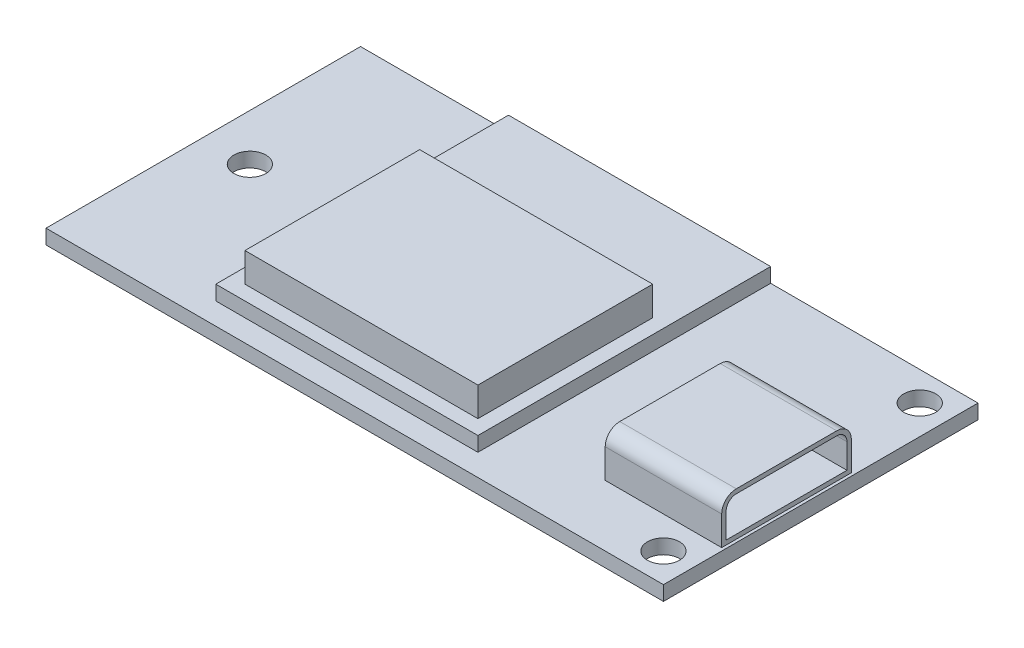
ISO-10303-21;
HEADER;
FILE_DESCRIPTION(('STEP AP214'),'2;1');
FILE_NAME('part.step','',(''),(''),'','','');
FILE_SCHEMA(('AUTOMOTIVE_DESIGN { 1 0 10303 214 1 1 1 1 }'));
ENDSEC;
DATA;
#1=APPLICATION_CONTEXT('core data for automotive mechanical design processes');
#2=APPLICATION_PROTOCOL_DEFINITION('international standard','automotive_design',2000,#1);
#3=PRODUCT_CONTEXT('',#1,'mechanical');
#4=PRODUCT('Part','Part','',(#3));
#5=PRODUCT_RELATED_PRODUCT_CATEGORY('part','',(#4));
#6=PRODUCT_DEFINITION_FORMATION('','',#4);
#7=PRODUCT_DEFINITION_CONTEXT('part definition',#1,'design');
#8=PRODUCT_DEFINITION('design','',#6,#7);
#9=PRODUCT_DEFINITION_SHAPE('','',#8);
#10=(LENGTH_UNIT() NAMED_UNIT(*) SI_UNIT(.MILLI.,.METRE.));
#11=(NAMED_UNIT(*) PLANE_ANGLE_UNIT() SI_UNIT($,.RADIAN.));
#12=(NAMED_UNIT(*) SI_UNIT($,.STERADIAN.) SOLID_ANGLE_UNIT());
#13=UNCERTAINTY_MEASURE_WITH_UNIT(LENGTH_MEASURE(1.E-05),#10,'distance_accuracy_value','');
#14=(GEOMETRIC_REPRESENTATION_CONTEXT(3) GLOBAL_UNCERTAINTY_ASSIGNED_CONTEXT((#13)) GLOBAL_UNIT_ASSIGNED_CONTEXT((#10,
#11,#12)) REPRESENTATION_CONTEXT('',''));
#15=CARTESIAN_POINT('',(0.,0.,0.));
#16=DIRECTION('',(0.,0.,1.));
#17=DIRECTION('',(1.,0.,0.));
#18=AXIS2_PLACEMENT_3D('',#15,#16,#17);
#19=CARTESIAN_POINT('',(6.96,4.,0.));
#20=DIRECTION('',(1.,0.,0.));
#21=DIRECTION('',(0.,0.,-1.));
#22=AXIS2_PLACEMENT_3D('',#19,#20,#21);
#23=PLANE('',#22);
#24=DIRECTION('',(0.,0.,-1.));
#25=VECTOR('',#24,1.);
#26=CARTESIAN_POINT('',(6.96,2.,0.));
#27=LINE('',#26,#25);
#28=CARTESIAN_POINT('',(6.96,2.,9.3));
#29=VERTEX_POINT('',#28);
#30=CARTESIAN_POINT('',(6.96,2.,-10.8));
#31=VERTEX_POINT('',#30);
#32=EDGE_CURVE('E303',#29,#31,#27,.T.);
#33=ORIENTED_EDGE('',*,*,#32,.F.);
#34=DIRECTION('',(0.,-1.,0.));
#35=VECTOR('',#34,1.);
#36=CARTESIAN_POINT('',(6.96,4.,9.3));
#37=LINE('',#36,#35);
#38=CARTESIAN_POINT('',(6.96,1.,9.3));
#39=VERTEX_POINT('',#38);
#40=EDGE_CURVE('E348',#29,#39,#37,.T.);
#41=ORIENTED_EDGE('',*,*,#40,.T.);
#42=DIRECTION('',(0.,0.,1.));
#43=VECTOR('',#42,1.);
#44=CARTESIAN_POINT('',(6.96,1.,0.));
#45=LINE('',#44,#43);
#46=CARTESIAN_POINT('',(6.96,1.,-10.8));
#47=VERTEX_POINT('',#46);
#48=EDGE_CURVE('E339',#47,#39,#45,.T.);
#49=ORIENTED_EDGE('',*,*,#48,.F.);
#50=DIRECTION('',(0.,-1.,0.));
#51=VECTOR('',#50,1.);
#52=CARTESIAN_POINT('',(6.96,2.,-10.8));
#53=LINE('',#52,#51);
#54=EDGE_CURVE('E310',#31,#47,#53,.T.);
#55=ORIENTED_EDGE('',*,*,#54,.F.);
#56=EDGE_LOOP('',(#33,#41,#49,#55));
#57=FACE_BOUND('',#56,.T.);
#58=ADVANCED_FACE('F64',(#57),#23,.T.);
#59=CARTESIAN_POINT('',(-11.04,4.,0.));
#60=DIRECTION('',(1.,0.,0.));
#61=DIRECTION('',(0.,0.,-1.));
#62=AXIS2_PLACEMENT_3D('',#59,#60,#61);
#63=PLANE('',#62);
#64=DIRECTION('',(0.,-1.,0.));
#65=VECTOR('',#64,1.);
#66=CARTESIAN_POINT('',(-11.04,4.,9.3));
#67=LINE('',#66,#65);
#68=CARTESIAN_POINT('',(-11.04,2.,9.3));
#69=VERTEX_POINT('',#68);
#70=CARTESIAN_POINT('',(-11.04,1.,9.3));
#71=VERTEX_POINT('',#70);
#72=EDGE_CURVE('E350',#69,#71,#67,.T.);
#73=ORIENTED_EDGE('',*,*,#72,.F.);
#74=DIRECTION('',(0.,0.,-1.));
#75=VECTOR('',#74,1.);
#76=CARTESIAN_POINT('',(-11.04,2.,0.));
#77=LINE('',#76,#75);
#78=CARTESIAN_POINT('',(-11.04,2.,-10.8));
#79=VERTEX_POINT('',#78);
#80=EDGE_CURVE('E300',#69,#79,#77,.T.);
#81=ORIENTED_EDGE('',*,*,#80,.T.);
#82=DIRECTION('',(0.,-1.,0.));
#83=VECTOR('',#82,1.);
#84=CARTESIAN_POINT('',(-11.04,2.,-10.8));
#85=LINE('',#84,#83);
#86=CARTESIAN_POINT('',(-11.04,1.,-10.8));
#87=VERTEX_POINT('',#86);
#88=EDGE_CURVE('E307',#79,#87,#85,.T.);
#89=ORIENTED_EDGE('',*,*,#88,.T.);
#90=DIRECTION('',(0.,0.,1.));
#91=VECTOR('',#90,1.);
#92=CARTESIAN_POINT('',(-11.04,1.,0.));
#93=LINE('',#92,#91);
#94=EDGE_CURVE('E342',#87,#71,#93,.T.);
#95=ORIENTED_EDGE('',*,*,#94,.T.);
#96=EDGE_LOOP('',(#73,#81,#89,#95));
#97=FACE_BOUND('',#96,.T.);
#98=ADVANCED_FACE('F456',(#97),#63,.F.);
#99=CARTESIAN_POINT('',(0.,4.,9.3));
#100=DIRECTION('',(0.,0.,-1.));
#101=DIRECTION('',(-1.,0.,0.));
#102=AXIS2_PLACEMENT_3D('',#99,#100,#101);
#103=PLANE('',#102);
#104=DIRECTION('',(-1.,0.,0.));
#105=VECTOR('',#104,1.);
#106=CARTESIAN_POINT('',(-11.04,2.,9.3));
#107=LINE('',#106,#105);
#108=EDGE_CURVE('E258',#29,#69,#107,.T.);
#109=ORIENTED_EDGE('',*,*,#108,.T.);
#110=ORIENTED_EDGE('',*,*,#72,.T.);
#111=DIRECTION('',(1.,0.,0.));
#112=VECTOR('',#111,1.);
#113=CARTESIAN_POINT('',(0.,1.,9.3));
#114=LINE('',#113,#112);
#115=EDGE_CURVE('E345',#71,#39,#114,.T.);
#116=ORIENTED_EDGE('',*,*,#115,.T.);
#117=ORIENTED_EDGE('',*,*,#40,.F.);
#118=EDGE_LOOP('',(#109,#110,#116,#117));
#119=FACE_BOUND('',#118,.T.);
#120=ADVANCED_FACE('F462',(#119),#103,.F.);
#121=CARTESIAN_POINT('',(0.,1.,0.));
#122=DIRECTION('',(0.,1.,0.));
#123=DIRECTION('',(0.,0.,1.));
#124=AXIS2_PLACEMENT_3D('',#121,#122,#123);
#125=PLANE('',#124);
#126=ORIENTED_EDGE('',*,*,#94,.F.);
#127=DIRECTION('',(-1.,0.,0.));
#128=VECTOR('',#127,1.);
#129=CARTESIAN_POINT('',(-21.2,1.,-10.8));
#130=LINE('',#129,#128);
#131=CARTESIAN_POINT('',(-21.2,1.,-10.8));
#132=VERTEX_POINT('',#131);
#133=EDGE_CURVE('E374',#87,#132,#130,.T.);
#134=ORIENTED_EDGE('',*,*,#133,.T.);
#135=DIRECTION('',(0.,0.,1.));
#136=VECTOR('',#135,1.);
#137=CARTESIAN_POINT('',(-21.2,1.,-10.8));
#138=LINE('',#137,#136);
#139=CARTESIAN_POINT('',(-21.2,1.,10.8));
#140=VERTEX_POINT('',#139);
#141=EDGE_CURVE('E379',#132,#140,#138,.T.);
#142=ORIENTED_EDGE('',*,*,#141,.T.);
#143=DIRECTION('',(1.,0.,0.));
#144=VECTOR('',#143,1.);
#145=CARTESIAN_POINT('',(-21.2,1.,10.8));
#146=LINE('',#145,#144);
#147=CARTESIAN_POINT('',(21.2,1.,10.8));
#148=VERTEX_POINT('',#147);
#149=EDGE_CURVE('E381',#140,#148,#146,.T.);
#150=ORIENTED_EDGE('',*,*,#149,.T.);
#151=DIRECTION('',(0.,0.,-1.));
#152=VECTOR('',#151,1.);
#153=CARTESIAN_POINT('',(21.2,1.,-10.8));
#154=LINE('',#153,#152);
#155=CARTESIAN_POINT('',(21.2,1.,-10.8));
#156=VERTEX_POINT('',#155);
#157=EDGE_CURVE('E371',#148,#156,#154,.T.);
#158=ORIENTED_EDGE('',*,*,#157,.T.);
#159=EDGE_CURVE('E376',#156,#47,#130,.T.);
#160=ORIENTED_EDGE('',*,*,#159,.T.);
#161=ORIENTED_EDGE('',*,*,#48,.T.);
#162=ORIENTED_EDGE('',*,*,#115,.F.);
#163=EDGE_LOOP('',(#126,#134,#142,#150,#158,#160,#161,#162));
#164=FACE_BOUND('',#163,.T.);
#165=DIRECTION('',(0.,0.,1.));
#166=VECTOR('',#165,1.);
#167=CARTESIAN_POINT('',(21.,1.,0.));
#168=LINE('',#167,#166);
#169=CARTESIAN_POINT('',(21.,1.,-2.3));
#170=VERTEX_POINT('',#169);
#171=CARTESIAN_POINT('',(21.,1.,6.6));
#172=VERTEX_POINT('',#171);
#173=EDGE_CURVE('E313',#170,#172,#168,.T.);
#174=ORIENTED_EDGE('',*,*,#173,.T.);
#175=DIRECTION('',(1.,0.,0.));
#176=VECTOR('',#175,1.);
#177=CARTESIAN_POINT('',(0.,1.,6.6));
#178=LINE('',#177,#176);
#179=CARTESIAN_POINT('',(13.,1.,6.6));
#180=VERTEX_POINT('',#179);
#181=EDGE_CURVE('E318',#180,#172,#178,.T.);
#182=ORIENTED_EDGE('',*,*,#181,.F.);
#183=DIRECTION('',(0.,0.,1.));
#184=VECTOR('',#183,1.);
#185=CARTESIAN_POINT('',(13.,1.,0.));
#186=LINE('',#185,#184);
#187=CARTESIAN_POINT('',(13.,1.,-2.3));
#188=VERTEX_POINT('',#187);
#189=EDGE_CURVE('E327',#188,#180,#186,.T.);
#190=ORIENTED_EDGE('',*,*,#189,.F.);
#191=DIRECTION('',(1.,0.,0.));
#192=VECTOR('',#191,1.);
#193=CARTESIAN_POINT('',(0.,1.,-2.3));
#194=LINE('',#193,#192);
#195=EDGE_CURVE('E324',#188,#170,#194,.T.);
#196=ORIENTED_EDGE('',*,*,#195,.T.);
#197=EDGE_LOOP('',(#174,#182,#190,#196));
#198=FACE_BOUND('',#197,.T.);
#199=CARTESIAN_POINT('',(19.2,1.,-8.8));
#200=DIRECTION('',(0.,1.,0.));
#201=DIRECTION('',(0.,0.,1.));
#202=AXIS2_PLACEMENT_3D('',#199,#200,#201);
#203=CIRCLE('',#202,1.1);
#204=CARTESIAN_POINT('',(19.2,1.,-7.7));
#205=VERTEX_POINT('',#204);
#206=EDGE_CURVE('E359',#205,#205,#203,.T.);
#207=ORIENTED_EDGE('',*,*,#206,.F.);
#208=EDGE_LOOP('',(#207));
#209=FACE_BOUND('',#208,.T.);
#210=CARTESIAN_POINT('',(-18.,1.,0.));
#211=DIRECTION('',(0.,1.,0.));
#212=DIRECTION('',(0.,0.,1.));
#213=AXIS2_PLACEMENT_3D('',#210,#211,#212);
#214=CIRCLE('',#213,1.1);
#215=CARTESIAN_POINT('',(-18.,1.,1.1));
#216=VERTEX_POINT('',#215);
#217=EDGE_CURVE('E365',#216,#216,#214,.T.);
#218=ORIENTED_EDGE('',*,*,#217,.F.);
#219=EDGE_LOOP('',(#218));
#220=FACE_BOUND('',#219,.T.);
#221=CARTESIAN_POINT('',(19.2,1.,8.8));
#222=DIRECTION('',(0.,1.,0.));
#223=DIRECTION('',(0.,0.,1.));
#224=AXIS2_PLACEMENT_3D('',#221,#222,#223);
#225=CIRCLE('',#224,1.1);
#226=CARTESIAN_POINT('',(19.2,1.,9.9));
#227=VERTEX_POINT('',#226);
#228=EDGE_CURVE('E353',#227,#227,#225,.T.);
#229=ORIENTED_EDGE('',*,*,#228,.F.);
#230=EDGE_LOOP('',(#229));
#231=FACE_BOUND('',#230,.T.);
#232=ADVANCED_FACE('F437',(#164,#198,#209,#220,#231),#125,.T.);
#233=CARTESIAN_POINT('',(0.,0.,0.));
#234=DIRECTION('',(0.,1.,0.));
#235=DIRECTION('',(0.,0.,1.));
#236=AXIS2_PLACEMENT_3D('',#233,#234,#235);
#237=PLANE('',#236);
#238=DIRECTION('',(0.,0.,-1.));
#239=VECTOR('',#238,1.);
#240=CARTESIAN_POINT('',(21.2,0.,-10.8));
#241=LINE('',#240,#239);
#242=CARTESIAN_POINT('',(21.2,0.,10.8));
#243=VERTEX_POINT('',#242);
#244=CARTESIAN_POINT('',(21.2,0.,-10.8));
#245=VERTEX_POINT('',#244);
#246=EDGE_CURVE('E368',#243,#245,#241,.T.);
#247=ORIENTED_EDGE('',*,*,#246,.F.);
#248=DIRECTION('',(1.,0.,0.));
#249=VECTOR('',#248,1.);
#250=CARTESIAN_POINT('',(-21.2,0.,10.8));
#251=LINE('',#250,#249);
#252=CARTESIAN_POINT('',(-21.2,0.,10.8));
#253=VERTEX_POINT('',#252);
#254=EDGE_CURVE('E375',#253,#243,#251,.T.);
#255=ORIENTED_EDGE('',*,*,#254,.F.);
#256=DIRECTION('',(0.,0.,1.));
#257=VECTOR('',#256,1.);
#258=CARTESIAN_POINT('',(-21.2,0.,-10.8));
#259=LINE('',#258,#257);
#260=CARTESIAN_POINT('',(-21.2,0.,-10.8));
#261=VERTEX_POINT('',#260);
#262=EDGE_CURVE('E388',#261,#253,#259,.T.);
#263=ORIENTED_EDGE('',*,*,#262,.F.);
#264=DIRECTION('',(-1.,0.,0.));
#265=VECTOR('',#264,1.);
#266=CARTESIAN_POINT('',(-21.2,0.,-10.8));
#267=LINE('',#266,#265);
#268=EDGE_CURVE('E386',#245,#261,#267,.T.);
#269=ORIENTED_EDGE('',*,*,#268,.F.);
#270=EDGE_LOOP('',(#247,#255,#263,#269));
#271=FACE_BOUND('',#270,.T.);
#272=CARTESIAN_POINT('',(-18.,0.,0.));
#273=DIRECTION('',(0.,1.,0.));
#274=DIRECTION('',(0.,0.,1.));
#275=AXIS2_PLACEMENT_3D('',#272,#273,#274);
#276=CIRCLE('',#275,1.1);
#277=CARTESIAN_POINT('',(-18.,0.,1.1));
#278=VERTEX_POINT('',#277);
#279=EDGE_CURVE('E362',#278,#278,#276,.T.);
#280=ORIENTED_EDGE('',*,*,#279,.T.);
#281=EDGE_LOOP('',(#280));
#282=FACE_BOUND('',#281,.T.);
#283=CARTESIAN_POINT('',(19.2,0.,-8.8));
#284=DIRECTION('',(0.,1.,0.));
#285=DIRECTION('',(0.,0.,1.));
#286=AXIS2_PLACEMENT_3D('',#283,#284,#285);
#287=CIRCLE('',#286,1.1);
#288=CARTESIAN_POINT('',(19.2,0.,-7.7));
#289=VERTEX_POINT('',#288);
#290=EDGE_CURVE('E356',#289,#289,#287,.T.);
#291=ORIENTED_EDGE('',*,*,#290,.T.);
#292=EDGE_LOOP('',(#291));
#293=FACE_BOUND('',#292,.T.);
#294=CARTESIAN_POINT('',(19.2,0.,8.8));
#295=DIRECTION('',(0.,1.,0.));
#296=DIRECTION('',(0.,0.,1.));
#297=AXIS2_PLACEMENT_3D('',#294,#295,#296);
#298=CIRCLE('',#297,1.1);
#299=CARTESIAN_POINT('',(19.2,0.,9.9));
#300=VERTEX_POINT('',#299);
#301=EDGE_CURVE('E352',#300,#300,#298,.T.);
#302=ORIENTED_EDGE('',*,*,#301,.T.);
#303=EDGE_LOOP('',(#302));
#304=FACE_BOUND('',#303,.T.);
#305=ADVANCED_FACE('F482',(#271,#282,#293,#304),#237,.F.);
#306=CARTESIAN_POINT('',(21.2,1.,-10.8));
#307=DIRECTION('',(-1.,0.,0.));
#308=DIRECTION('',(0.,0.,1.));
#309=AXIS2_PLACEMENT_3D('',#306,#307,#308);
#310=PLANE('',#309);
#311=ORIENTED_EDGE('',*,*,#246,.T.);
#312=DIRECTION('',(0.,-1.,0.));
#313=VECTOR('',#312,1.);
#314=CARTESIAN_POINT('',(21.2,1.,-10.8));
#315=LINE('',#314,#313);
#316=EDGE_CURVE('E399',#156,#245,#315,.T.);
#317=ORIENTED_EDGE('',*,*,#316,.F.);
#318=ORIENTED_EDGE('',*,*,#157,.F.);
#319=DIRECTION('',(0.,-1.,0.));
#320=VECTOR('',#319,1.);
#321=CARTESIAN_POINT('',(21.2,1.,10.8));
#322=LINE('',#321,#320);
#323=EDGE_CURVE('E383',#148,#243,#322,.T.);
#324=ORIENTED_EDGE('',*,*,#323,.T.);
#325=EDGE_LOOP('',(#311,#317,#318,#324));
#326=FACE_BOUND('',#325,.T.);
#327=ADVANCED_FACE('F486',(#326),#310,.F.);
#328=CARTESIAN_POINT('',(-21.2,1.,-10.8));
#329=DIRECTION('',(0.,0.,1.));
#330=DIRECTION('',(1.,0.,0.));
#331=AXIS2_PLACEMENT_3D('',#328,#329,#330);
#332=PLANE('',#331);
#333=ORIENTED_EDGE('',*,*,#268,.T.);
#334=DIRECTION('',(0.,-1.,0.));
#335=VECTOR('',#334,1.);
#336=CARTESIAN_POINT('',(-21.2,1.,-10.8));
#337=LINE('',#336,#335);
#338=EDGE_CURVE('E396',#132,#261,#337,.T.);
#339=ORIENTED_EDGE('',*,*,#338,.F.);
#340=ORIENTED_EDGE('',*,*,#133,.F.);
#341=ORIENTED_EDGE('',*,*,#88,.F.);
#342=DIRECTION('',(-1.,0.,0.));
#343=VECTOR('',#342,1.);
#344=CARTESIAN_POINT('',(0.,2.,-10.8));
#345=LINE('',#344,#343);
#346=EDGE_CURVE('E305',#31,#79,#345,.T.);
#347=ORIENTED_EDGE('',*,*,#346,.F.);
#348=ORIENTED_EDGE('',*,*,#54,.T.);
#349=ORIENTED_EDGE('',*,*,#159,.F.);
#350=ORIENTED_EDGE('',*,*,#316,.T.);
#351=EDGE_LOOP('',(#333,#339,#340,#341,#347,#348,#349,#350));
#352=FACE_BOUND('',#351,.T.);
#353=ADVANCED_FACE('F494',(#352),#332,.F.);
#354=CARTESIAN_POINT('',(-21.2,1.,-10.8));
#355=DIRECTION('',(1.,0.,0.));
#356=DIRECTION('',(0.,0.,-1.));
#357=AXIS2_PLACEMENT_3D('',#354,#355,#356);
#358=PLANE('',#357);
#359=ORIENTED_EDGE('',*,*,#262,.T.);
#360=DIRECTION('',(0.,-1.,0.));
#361=VECTOR('',#360,1.);
#362=CARTESIAN_POINT('',(-21.2,1.,10.8));
#363=LINE('',#362,#361);
#364=EDGE_CURVE('E393',#140,#253,#363,.T.);
#365=ORIENTED_EDGE('',*,*,#364,.F.);
#366=ORIENTED_EDGE('',*,*,#141,.F.);
#367=ORIENTED_EDGE('',*,*,#338,.T.);
#368=EDGE_LOOP('',(#359,#365,#366,#367));
#369=FACE_BOUND('',#368,.T.);
#370=ADVANCED_FACE('F490',(#369),#358,.F.);
#371=CARTESIAN_POINT('',(-21.2,1.,10.8));
#372=DIRECTION('',(0.,0.,-1.));
#373=DIRECTION('',(-1.,0.,0.));
#374=AXIS2_PLACEMENT_3D('',#371,#372,#373);
#375=PLANE('',#374);
#376=ORIENTED_EDGE('',*,*,#254,.T.);
#377=ORIENTED_EDGE('',*,*,#323,.F.);
#378=ORIENTED_EDGE('',*,*,#149,.F.);
#379=ORIENTED_EDGE('',*,*,#364,.T.);
#380=EDGE_LOOP('',(#376,#377,#378,#379));
#381=FACE_BOUND('',#380,.T.);
#382=ADVANCED_FACE('F478',(#381),#375,.F.);
#383=CARTESIAN_POINT('',(-18.,1.,0.));
#384=DIRECTION('',(0.,-1.,0.));
#385=DIRECTION('',(0.,0.,-1.));
#386=AXIS2_PLACEMENT_3D('',#383,#384,#385);
#387=CYLINDRICAL_SURFACE('',#386,1.1);
#388=ORIENTED_EDGE('',*,*,#217,.T.);
#389=EDGE_LOOP('',(#388));
#390=FACE_BOUND('',#389,.T.);
#391=ORIENTED_EDGE('',*,*,#279,.F.);
#392=EDGE_LOOP('',(#391));
#393=FACE_BOUND('',#392,.T.);
#394=ADVANCED_FACE('F474',(#390,#393),#387,.F.);
#395=CARTESIAN_POINT('',(19.2,1.,-8.8));
#396=DIRECTION('',(0.,-1.,0.));
#397=DIRECTION('',(0.,0.,-1.));
#398=AXIS2_PLACEMENT_3D('',#395,#396,#397);
#399=CYLINDRICAL_SURFACE('',#398,1.1);
#400=ORIENTED_EDGE('',*,*,#206,.T.);
#401=EDGE_LOOP('',(#400));
#402=FACE_BOUND('',#401,.T.);
#403=ORIENTED_EDGE('',*,*,#290,.F.);
#404=EDGE_LOOP('',(#403));
#405=FACE_BOUND('',#404,.T.);
#406=ADVANCED_FACE('F470',(#402,#405),#399,.F.);
#407=CARTESIAN_POINT('',(19.2,1.,8.8));
#408=DIRECTION('',(0.,-1.,0.));
#409=DIRECTION('',(0.,0.,-1.));
#410=AXIS2_PLACEMENT_3D('',#407,#408,#409);
#411=CYLINDRICAL_SURFACE('',#410,1.1);
#412=ORIENTED_EDGE('',*,*,#228,.T.);
#413=EDGE_LOOP('',(#412));
#414=FACE_BOUND('',#413,.T.);
#415=ORIENTED_EDGE('',*,*,#301,.F.);
#416=EDGE_LOOP('',(#415));
#417=FACE_BOUND('',#416,.T.);
#418=ADVANCED_FACE('F467',(#414,#417),#411,.F.);
#419=CARTESIAN_POINT('',(21.,4.,0.));
#420=DIRECTION('',(1.,0.,0.));
#421=DIRECTION('',(0.,0.,-1.));
#422=AXIS2_PLACEMENT_3D('',#419,#420,#421);
#423=PLANE('',#422);
#424=CARTESIAN_POINT('',(21.,3.,-1.29999999999999));
#425=DIRECTION('',(1.,0.,0.));
#426=DIRECTION('',(0.,0.,-1.));
#427=AXIS2_PLACEMENT_3D('',#424,#425,#426);
#428=CIRCLE('',#427,0.7);
#429=CARTESIAN_POINT('',(21.,3.,-1.99999999999999));
#430=VERTEX_POINT('',#429);
#431=CARTESIAN_POINT('',(21.,3.7,-1.29999999999999));
#432=VERTEX_POINT('',#431);
#433=EDGE_CURVE('E87',#430,#432,#428,.T.);
#434=ORIENTED_EDGE('',*,*,#433,.F.);
#435=DIRECTION('',(0.,1.,0.));
#436=VECTOR('',#435,1.);
#437=CARTESIAN_POINT('',(21.,1.3,-1.99999999999999));
#438=LINE('',#437,#436);
#439=CARTESIAN_POINT('',(21.,1.3,-1.99999999999999));
#440=VERTEX_POINT('',#439);
#441=EDGE_CURVE('E285',#440,#430,#438,.T.);
#442=ORIENTED_EDGE('',*,*,#441,.F.);
#443=DIRECTION('',(0.,0.,-1.));
#444=VECTOR('',#443,1.);
#445=CARTESIAN_POINT('',(21.,1.3,6.30000000000001));
#446=LINE('',#445,#444);
#447=CARTESIAN_POINT('',(21.,1.3,6.30000000000001));
#448=VERTEX_POINT('',#447);
#449=EDGE_CURVE('E282',#448,#440,#446,.T.);
#450=ORIENTED_EDGE('',*,*,#449,.F.);
#451=DIRECTION('',(0.,-1.,0.));
#452=VECTOR('',#451,1.);
#453=CARTESIAN_POINT('',(21.,3.,6.30000000000001));
#454=LINE('',#453,#452);
#455=CARTESIAN_POINT('',(21.,3.,6.30000000000001));
#456=VERTEX_POINT('',#455);
#457=EDGE_CURVE('E279',#456,#448,#454,.T.);
#458=ORIENTED_EDGE('',*,*,#457,.F.);
#459=CARTESIAN_POINT('',(21.,3.,5.60000000000001));
#460=DIRECTION('',(1.,0.,0.));
#461=DIRECTION('',(0.,0.,-1.));
#462=AXIS2_PLACEMENT_3D('',#459,#460,#461);
#463=CIRCLE('',#462,0.7);
#464=CARTESIAN_POINT('',(21.,3.7,5.60000000000001));
#465=VERTEX_POINT('',#464);
#466=EDGE_CURVE('E276',#465,#456,#463,.T.);
#467=ORIENTED_EDGE('',*,*,#466,.F.);
#468=DIRECTION('',(0.,0.,1.));
#469=VECTOR('',#468,1.);
#470=CARTESIAN_POINT('',(21.,3.7,-1.29999999999999));
#471=LINE('',#470,#469);
#472=EDGE_CURVE('E272',#432,#465,#471,.T.);
#473=ORIENTED_EDGE('',*,*,#472,.F.);
#474=EDGE_LOOP('',(#434,#442,#450,#458,#467,#473));
#475=FACE_BOUND('',#474,.T.);
#476=DIRECTION('',(0.,0.,1.));
#477=VECTOR('',#476,1.);
#478=CARTESIAN_POINT('',(21.,4.,0.));
#479=LINE('',#478,#477);
#480=CARTESIAN_POINT('',(21.,4.,-1.3));
#481=VERTEX_POINT('',#480);
#482=CARTESIAN_POINT('',(21.,4.,5.6));
#483=VERTEX_POINT('',#482);
#484=EDGE_CURVE('E314',#481,#483,#479,.T.);
#485=ORIENTED_EDGE('',*,*,#484,.T.);
#486=CARTESIAN_POINT('',(21.,3.,5.6));
#487=DIRECTION('',(1.,0.,0.));
#488=DIRECTION('',(0.,0.,-1.));
#489=AXIS2_PLACEMENT_3D('',#486,#487,#488);
#490=CIRCLE('',#489,1.);
#491=CARTESIAN_POINT('',(21.,3.,6.6));
#492=VERTEX_POINT('',#491);
#493=EDGE_CURVE('E409',#483,#492,#490,.T.);
#494=ORIENTED_EDGE('',*,*,#493,.T.);
#495=DIRECTION('',(0.,-1.,0.));
#496=VECTOR('',#495,1.);
#497=CARTESIAN_POINT('',(21.,4.,6.6));
#498=LINE('',#497,#496);
#499=EDGE_CURVE('E321',#492,#172,#498,.T.);
#500=ORIENTED_EDGE('',*,*,#499,.T.);
#501=ORIENTED_EDGE('',*,*,#173,.F.);
#502=DIRECTION('',(0.,-1.,0.));
#503=VECTOR('',#502,1.);
#504=CARTESIAN_POINT('',(21.,4.,-2.3));
#505=LINE('',#504,#503);
#506=CARTESIAN_POINT('',(21.,3.,-2.3));
#507=VERTEX_POINT('',#506);
#508=EDGE_CURVE('E337',#507,#170,#505,.T.);
#509=ORIENTED_EDGE('',*,*,#508,.F.);
#510=CARTESIAN_POINT('',(21.,3.,-1.3));
#511=DIRECTION('',(1.,0.,0.));
#512=DIRECTION('',(0.,0.,-1.));
#513=AXIS2_PLACEMENT_3D('',#510,#511,#512);
#514=CIRCLE('',#513,1.);
#515=EDGE_CURVE('E407',#507,#481,#514,.T.);
#516=ORIENTED_EDGE('',*,*,#515,.T.);
#517=EDGE_LOOP('',(#485,#494,#500,#501,#509,#516));
#518=FACE_BOUND('',#517,.T.);
#519=ADVANCED_FACE('F430',(#475,#518),#423,.T.);
#520=CARTESIAN_POINT('',(0.,4.,-2.3));
#521=DIRECTION('',(0.,0.,-1.));
#522=DIRECTION('',(-1.,0.,0.));
#523=AXIS2_PLACEMENT_3D('',#520,#521,#522);
#524=PLANE('',#523);
#525=DIRECTION('',(0.,-1.,0.));
#526=VECTOR('',#525,1.);
#527=CARTESIAN_POINT('',(13.,4.,-2.3));
#528=LINE('',#527,#526);
#529=CARTESIAN_POINT('',(13.,3.,-2.3));
#530=VERTEX_POINT('',#529);
#531=EDGE_CURVE('E335',#530,#188,#528,.T.);
#532=ORIENTED_EDGE('',*,*,#531,.F.);
#533=DIRECTION('',(1.,0.,0.));
#534=VECTOR('',#533,1.);
#535=CARTESIAN_POINT('',(0.,3.,-2.3));
#536=LINE('',#535,#534);
#537=EDGE_CURVE('E13',#530,#507,#536,.T.);
#538=ORIENTED_EDGE('',*,*,#537,.T.);
#539=ORIENTED_EDGE('',*,*,#508,.T.);
#540=ORIENTED_EDGE('',*,*,#195,.F.);
#541=EDGE_LOOP('',(#532,#538,#539,#540));
#542=FACE_BOUND('',#541,.T.);
#543=ADVANCED_FACE('F443',(#542),#524,.T.);
#544=CARTESIAN_POINT('',(13.,4.,0.));
#545=DIRECTION('',(1.,0.,0.));
#546=DIRECTION('',(0.,0.,-1.));
#547=AXIS2_PLACEMENT_3D('',#544,#545,#546);
#548=PLANE('',#547);
#549=DIRECTION('',(0.,-1.,0.));
#550=VECTOR('',#549,1.);
#551=CARTESIAN_POINT('',(13.,4.,6.6));
#552=LINE('',#551,#550);
#553=CARTESIAN_POINT('',(13.,3.,6.6));
#554=VERTEX_POINT('',#553);
#555=EDGE_CURVE('E333',#554,#180,#552,.T.);
#556=ORIENTED_EDGE('',*,*,#555,.F.);
#557=CARTESIAN_POINT('',(13.,3.,5.6));
#558=DIRECTION('',(1.,0.,0.));
#559=DIRECTION('',(0.,0.,-1.));
#560=AXIS2_PLACEMENT_3D('',#557,#558,#559);
#561=CIRCLE('',#560,1.);
#562=CARTESIAN_POINT('',(13.,4.,5.6));
#563=VERTEX_POINT('',#562);
#564=EDGE_CURVE('E72',#554,#563,#561,.F.);
#565=ORIENTED_EDGE('',*,*,#564,.T.);
#566=DIRECTION('',(0.,0.,1.));
#567=VECTOR('',#566,1.);
#568=CARTESIAN_POINT('',(13.,4.,0.));
#569=LINE('',#568,#567);
#570=CARTESIAN_POINT('',(13.,4.,-1.3));
#571=VERTEX_POINT('',#570);
#572=EDGE_CURVE('E317',#571,#563,#569,.T.);
#573=ORIENTED_EDGE('',*,*,#572,.F.);
#574=CARTESIAN_POINT('',(13.,3.,-1.3));
#575=DIRECTION('',(1.,0.,0.));
#576=DIRECTION('',(0.,0.,-1.));
#577=AXIS2_PLACEMENT_3D('',#574,#575,#576);
#578=CIRCLE('',#577,1.);
#579=EDGE_CURVE('E413',#571,#530,#578,.F.);
#580=ORIENTED_EDGE('',*,*,#579,.T.);
#581=ORIENTED_EDGE('',*,*,#531,.T.);
#582=ORIENTED_EDGE('',*,*,#189,.T.);
#583=EDGE_LOOP('',(#556,#565,#573,#580,#581,#582));
#584=FACE_BOUND('',#583,.T.);
#585=ADVANCED_FACE('F418',(#584),#548,.F.);
#586=CARTESIAN_POINT('',(0.,4.,6.6));
#587=DIRECTION('',(0.,0.,-1.));
#588=DIRECTION('',(-1.,0.,0.));
#589=AXIS2_PLACEMENT_3D('',#586,#587,#588);
#590=PLANE('',#589);
#591=ORIENTED_EDGE('',*,*,#499,.F.);
#592=DIRECTION('',(1.,0.,0.));
#593=VECTOR('',#592,1.);
#594=CARTESIAN_POINT('',(13.,3.,6.6));
#595=LINE('',#594,#593);
#596=EDGE_CURVE('E411',#492,#554,#595,.F.);
#597=ORIENTED_EDGE('',*,*,#596,.T.);
#598=ORIENTED_EDGE('',*,*,#555,.T.);
#599=ORIENTED_EDGE('',*,*,#181,.T.);
#600=EDGE_LOOP('',(#591,#597,#598,#599));
#601=FACE_BOUND('',#600,.T.);
#602=ADVANCED_FACE('F433',(#601),#590,.F.);
#603=CARTESIAN_POINT('',(0.,4.,0.));
#604=DIRECTION('',(0.,1.,0.));
#605=DIRECTION('',(0.,0.,1.));
#606=AXIS2_PLACEMENT_3D('',#603,#604,#605);
#607=PLANE('',#606);
#608=ORIENTED_EDGE('',*,*,#572,.T.);
#609=DIRECTION('',(1.,0.,0.));
#610=VECTOR('',#609,1.);
#611=CARTESIAN_POINT('',(21.,4.,5.6));
#612=LINE('',#611,#610);
#613=EDGE_CURVE('E404',#563,#483,#612,.T.);
#614=ORIENTED_EDGE('',*,*,#613,.T.);
#615=ORIENTED_EDGE('',*,*,#484,.F.);
#616=DIRECTION('',(1.,0.,0.));
#617=VECTOR('',#616,1.);
#618=CARTESIAN_POINT('',(0.,4.,-1.3));
#619=LINE('',#618,#617);
#620=EDGE_CURVE('E402',#481,#571,#619,.F.);
#621=ORIENTED_EDGE('',*,*,#620,.T.);
#622=EDGE_LOOP('',(#608,#614,#615,#621));
#623=FACE_BOUND('',#622,.T.);
#624=ADVANCED_FACE('F424',(#623),#607,.T.);
#625=CARTESIAN_POINT('',(0.,3.,5.6));
#626=DIRECTION('',(-1.,0.,0.));
#627=DIRECTION('',(0.,0.,1.));
#628=AXIS2_PLACEMENT_3D('',#625,#626,#627);
#629=CYLINDRICAL_SURFACE('',#628,1.);
#630=ORIENTED_EDGE('',*,*,#564,.F.);
#631=ORIENTED_EDGE('',*,*,#596,.F.);
#632=ORIENTED_EDGE('',*,*,#493,.F.);
#633=ORIENTED_EDGE('',*,*,#613,.F.);
#634=EDGE_LOOP('',(#630,#631,#632,#633));
#635=FACE_BOUND('',#634,.T.);
#636=ADVANCED_FACE('F427',(#635),#629,.T.);
#637=CARTESIAN_POINT('',(0.,3.,-1.3));
#638=DIRECTION('',(1.,0.,0.));
#639=DIRECTION('',(0.,0.,-1.));
#640=AXIS2_PLACEMENT_3D('',#637,#638,#639);
#641=CYLINDRICAL_SURFACE('',#640,1.);
#642=ORIENTED_EDGE('',*,*,#579,.F.);
#643=ORIENTED_EDGE('',*,*,#620,.F.);
#644=ORIENTED_EDGE('',*,*,#515,.F.);
#645=ORIENTED_EDGE('',*,*,#537,.F.);
#646=EDGE_LOOP('',(#642,#643,#644,#645));
#647=FACE_BOUND('',#646,.T.);
#648=ADVANCED_FACE('F66',(#647),#641,.T.);
#649=CARTESIAN_POINT('',(0.,2.,0.));
#650=DIRECTION('',(0.,1.,0.));
#651=DIRECTION('',(0.,0.,1.));
#652=AXIS2_PLACEMENT_3D('',#649,#650,#651);
#653=PLANE('',#652);
#654=ORIENTED_EDGE('',*,*,#80,.F.);
#655=ORIENTED_EDGE('',*,*,#108,.F.);
#656=ORIENTED_EDGE('',*,*,#32,.T.);
#657=ORIENTED_EDGE('',*,*,#346,.T.);
#658=EDGE_LOOP('',(#654,#655,#656,#657));
#659=FACE_BOUND('',#658,.T.);
#660=DIRECTION('',(0.,0.,1.));
#661=VECTOR('',#660,1.);
#662=CARTESIAN_POINT('',(5.96,2.,9.3));
#663=LINE('',#662,#661);
#664=CARTESIAN_POINT('',(5.96,2.,-3.7));
#665=VERTEX_POINT('',#664);
#666=CARTESIAN_POINT('',(5.96,2.,8.3));
#667=VERTEX_POINT('',#666);
#668=EDGE_CURVE('E229',#665,#667,#663,.T.);
#669=ORIENTED_EDGE('',*,*,#668,.T.);
#670=DIRECTION('',(-1.,0.,0.));
#671=VECTOR('',#670,1.);
#672=CARTESIAN_POINT('',(-11.04,2.,8.3));
#673=LINE('',#672,#671);
#674=CARTESIAN_POINT('',(-10.04,2.,8.3));
#675=VERTEX_POINT('',#674);
#676=EDGE_CURVE('E525',#667,#675,#673,.T.);
#677=ORIENTED_EDGE('',*,*,#676,.T.);
#678=DIRECTION('',(0.,0.,-1.));
#679=VECTOR('',#678,1.);
#680=CARTESIAN_POINT('',(-10.04,2.,-4.7));
#681=LINE('',#680,#679);
#682=CARTESIAN_POINT('',(-10.04,2.,-3.7));
#683=VERTEX_POINT('',#682);
#684=EDGE_CURVE('E527',#675,#683,#681,.T.);
#685=ORIENTED_EDGE('',*,*,#684,.T.);
#686=DIRECTION('',(1.,0.,0.));
#687=VECTOR('',#686,1.);
#688=CARTESIAN_POINT('',(6.96,2.,-3.7));
#689=LINE('',#688,#687);
#690=EDGE_CURVE('E273',#683,#665,#689,.T.);
#691=ORIENTED_EDGE('',*,*,#690,.T.);
#692=EDGE_LOOP('',(#669,#677,#685,#691));
#693=FACE_BOUND('',#692,.T.);
#694=ADVANCED_FACE('F447',(#659,#693),#653,.T.);
#695=CARTESIAN_POINT('',(4.35997685188286,3.,-1.29999999999998));
#696=DIRECTION('',(1.,0.,0.));
#697=DIRECTION('',(0.,0.,-1.));
#698=AXIS2_PLACEMENT_3D('',#695,#696,#697);
#699=CYLINDRICAL_SURFACE('',#698,0.7);
#700=CARTESIAN_POINT('',(13.3,3.,-1.29999999999999));
#701=DIRECTION('',(1.,0.,0.));
#702=DIRECTION('',(0.,0.,-1.));
#703=AXIS2_PLACEMENT_3D('',#700,#701,#702);
#704=CIRCLE('',#703,0.7);
#705=CARTESIAN_POINT('',(13.3,3.7,-1.29999999999999));
#706=VERTEX_POINT('',#705);
#707=CARTESIAN_POINT('',(13.3,3.,-1.99999999999999));
#708=VERTEX_POINT('',#707);
#709=EDGE_CURVE('E268',#706,#708,#704,.F.);
#710=ORIENTED_EDGE('',*,*,#709,.T.);
#711=DIRECTION('',(1.,0.,0.));
#712=VECTOR('',#711,1.);
#713=CARTESIAN_POINT('',(4.35997685188286,3.,-1.99999999999998));
#714=LINE('',#713,#712);
#715=EDGE_CURVE('E262',#708,#430,#714,.T.);
#716=ORIENTED_EDGE('',*,*,#715,.T.);
#717=ORIENTED_EDGE('',*,*,#433,.T.);
#718=DIRECTION('',(1.,0.,0.));
#719=VECTOR('',#718,1.);
#720=CARTESIAN_POINT('',(4.35997685188286,3.7,-1.29999999999998));
#721=LINE('',#720,#719);
#722=EDGE_CURVE('E288',#706,#432,#721,.T.);
#723=ORIENTED_EDGE('',*,*,#722,.F.);
#724=EDGE_LOOP('',(#710,#716,#717,#723));
#725=FACE_BOUND('',#724,.T.);
#726=ADVANCED_FACE('F452',(#725),#699,.F.);
#727=CARTESIAN_POINT('',(4.35997685188286,1.3,-1.99999999999998));
#728=DIRECTION('',(0.,0.,-1.));
#729=DIRECTION('',(-1.,0.,0.));
#730=AXIS2_PLACEMENT_3D('',#727,#728,#729);
#731=PLANE('',#730);
#732=DIRECTION('',(0.,-1.,0.));
#733=VECTOR('',#732,1.);
#734=CARTESIAN_POINT('',(13.3,1.3,-1.99999999999999));
#735=LINE('',#734,#733);
#736=CARTESIAN_POINT('',(13.3,1.3,-1.99999999999999));
#737=VERTEX_POINT('',#736);
#738=EDGE_CURVE('E266',#708,#737,#735,.T.);
#739=ORIENTED_EDGE('',*,*,#738,.T.);
#740=DIRECTION('',(1.,0.,0.));
#741=VECTOR('',#740,1.);
#742=CARTESIAN_POINT('',(4.35997685188286,1.3,-1.99999999999998));
#743=LINE('',#742,#741);
#744=EDGE_CURVE('E290',#737,#440,#743,.T.);
#745=ORIENTED_EDGE('',*,*,#744,.T.);
#746=ORIENTED_EDGE('',*,*,#441,.T.);
#747=ORIENTED_EDGE('',*,*,#715,.F.);
#748=EDGE_LOOP('',(#739,#745,#746,#747));
#749=FACE_BOUND('',#748,.T.);
#750=ADVANCED_FACE('F553',(#749),#731,.F.);
#751=CARTESIAN_POINT('',(4.35997685188287,1.3,6.30000000000002));
#752=DIRECTION('',(0.,-1.,0.));
#753=DIRECTION('',(0.,0.,-1.));
#754=AXIS2_PLACEMENT_3D('',#751,#752,#753);
#755=PLANE('',#754);
#756=DIRECTION('',(0.,0.,1.));
#757=VECTOR('',#756,1.);
#758=CARTESIAN_POINT('',(13.3,1.3,6.30000000000002));
#759=LINE('',#758,#757);
#760=CARTESIAN_POINT('',(13.3,1.3,6.30000000000001));
#761=VERTEX_POINT('',#760);
#762=EDGE_CURVE('E264',#737,#761,#759,.T.);
#763=ORIENTED_EDGE('',*,*,#762,.T.);
#764=DIRECTION('',(1.,0.,0.));
#765=VECTOR('',#764,1.);
#766=CARTESIAN_POINT('',(4.35997685188287,1.3,6.30000000000002));
#767=LINE('',#766,#765);
#768=EDGE_CURVE('E292',#761,#448,#767,.T.);
#769=ORIENTED_EDGE('',*,*,#768,.T.);
#770=ORIENTED_EDGE('',*,*,#449,.T.);
#771=ORIENTED_EDGE('',*,*,#744,.F.);
#772=EDGE_LOOP('',(#763,#769,#770,#771));
#773=FACE_BOUND('',#772,.T.);
#774=ADVANCED_FACE('F556',(#773),#755,.F.);
#775=CARTESIAN_POINT('',(4.35997685188287,3.,6.30000000000002));
#776=DIRECTION('',(0.,0.,1.));
#777=DIRECTION('',(1.,0.,0.));
#778=AXIS2_PLACEMENT_3D('',#775,#776,#777);
#779=PLANE('',#778);
#780=DIRECTION('',(0.,1.,0.));
#781=VECTOR('',#780,1.);
#782=CARTESIAN_POINT('',(13.3,3.,6.30000000000001));
#783=LINE('',#782,#781);
#784=CARTESIAN_POINT('',(13.3,3.,6.30000000000001));
#785=VERTEX_POINT('',#784);
#786=EDGE_CURVE('E261',#761,#785,#783,.T.);
#787=ORIENTED_EDGE('',*,*,#786,.T.);
#788=DIRECTION('',(1.,0.,0.));
#789=VECTOR('',#788,1.);
#790=CARTESIAN_POINT('',(4.35997685188287,3.,6.30000000000002));
#791=LINE('',#790,#789);
#792=EDGE_CURVE('E294',#785,#456,#791,.T.);
#793=ORIENTED_EDGE('',*,*,#792,.T.);
#794=ORIENTED_EDGE('',*,*,#457,.T.);
#795=ORIENTED_EDGE('',*,*,#768,.F.);
#796=EDGE_LOOP('',(#787,#793,#794,#795));
#797=FACE_BOUND('',#796,.T.);
#798=ADVANCED_FACE('F560',(#797),#779,.F.);
#799=CARTESIAN_POINT('',(4.35997685188287,3.,5.60000000000002));
#800=DIRECTION('',(1.,0.,0.));
#801=DIRECTION('',(0.,0.,-1.));
#802=AXIS2_PLACEMENT_3D('',#799,#800,#801);
#803=CYLINDRICAL_SURFACE('',#802,0.7);
#804=CARTESIAN_POINT('',(13.3,3.,5.60000000000001));
#805=DIRECTION('',(1.,0.,0.));
#806=DIRECTION('',(0.,0.,-1.));
#807=AXIS2_PLACEMENT_3D('',#804,#805,#806);
#808=CIRCLE('',#807,0.7);
#809=CARTESIAN_POINT('',(13.3,3.7,5.60000000000001));
#810=VERTEX_POINT('',#809);
#811=EDGE_CURVE('E259',#785,#810,#808,.F.);
#812=ORIENTED_EDGE('',*,*,#811,.T.);
#813=DIRECTION('',(1.,0.,0.));
#814=VECTOR('',#813,1.);
#815=CARTESIAN_POINT('',(4.35997685188287,3.7,5.60000000000002));
#816=LINE('',#815,#814);
#817=EDGE_CURVE('E296',#810,#465,#816,.T.);
#818=ORIENTED_EDGE('',*,*,#817,.T.);
#819=ORIENTED_EDGE('',*,*,#466,.T.);
#820=ORIENTED_EDGE('',*,*,#792,.F.);
#821=EDGE_LOOP('',(#812,#818,#819,#820));
#822=FACE_BOUND('',#821,.T.);
#823=ADVANCED_FACE('F564',(#822),#803,.F.);
#824=CARTESIAN_POINT('',(4.35997685188286,3.7,-1.29999999999998));
#825=DIRECTION('',(0.,1.,0.));
#826=DIRECTION('',(0.,0.,1.));
#827=AXIS2_PLACEMENT_3D('',#824,#825,#826);
#828=PLANE('',#827);
#829=DIRECTION('',(0.,0.,-1.));
#830=VECTOR('',#829,1.);
#831=CARTESIAN_POINT('',(13.3,3.7,-1.29999999999998));
#832=LINE('',#831,#830);
#833=EDGE_CURVE('E270',#810,#706,#832,.T.);
#834=ORIENTED_EDGE('',*,*,#833,.T.);
#835=ORIENTED_EDGE('',*,*,#722,.T.);
#836=ORIENTED_EDGE('',*,*,#472,.T.);
#837=ORIENTED_EDGE('',*,*,#817,.F.);
#838=EDGE_LOOP('',(#834,#835,#836,#837));
#839=FACE_BOUND('',#838,.T.);
#840=ADVANCED_FACE('F551',(#839),#828,.F.);
#841=CARTESIAN_POINT('',(13.3,4.,0.));
#842=DIRECTION('',(1.,0.,0.));
#843=DIRECTION('',(0.,0.,-1.));
#844=AXIS2_PLACEMENT_3D('',#841,#842,#843);
#845=PLANE('',#844);
#846=ORIENTED_EDGE('',*,*,#709,.F.);
#847=ORIENTED_EDGE('',*,*,#833,.F.);
#848=ORIENTED_EDGE('',*,*,#811,.F.);
#849=ORIENTED_EDGE('',*,*,#786,.F.);
#850=ORIENTED_EDGE('',*,*,#762,.F.);
#851=ORIENTED_EDGE('',*,*,#738,.F.);
#852=EDGE_LOOP('',(#846,#847,#848,#849,#850,#851));
#853=FACE_BOUND('',#852,.T.);
#854=ADVANCED_FACE('F548',(#853),#845,.T.);
#855=CARTESIAN_POINT('',(5.96,-20.8035085019828,9.3));
#856=DIRECTION('',(1.,0.,0.));
#857=DIRECTION('',(0.,0.,-1.));
#858=AXIS2_PLACEMENT_3D('',#855,#856,#857);
#859=PLANE('',#858);
#860=DIRECTION('',(0.,1.,0.));
#861=VECTOR('',#860,1.);
#862=CARTESIAN_POINT('',(5.96,-20.8035085019828,-3.7));
#863=LINE('',#862,#861);
#864=CARTESIAN_POINT('',(5.96,4.,-3.7));
#865=VERTEX_POINT('',#864);
#866=EDGE_CURVE('E225',#665,#865,#863,.T.);
#867=ORIENTED_EDGE('',*,*,#866,.T.);
#868=DIRECTION('',(0.,0.,-1.));
#869=VECTOR('',#868,1.);
#870=CARTESIAN_POINT('',(5.96,4.,9.3));
#871=LINE('',#870,#869);
#872=CARTESIAN_POINT('',(5.96,4.,8.3));
#873=VERTEX_POINT('',#872);
#874=EDGE_CURVE('E79',#873,#865,#871,.T.);
#875=ORIENTED_EDGE('',*,*,#874,.F.);
#876=DIRECTION('',(0.,1.,0.));
#877=VECTOR('',#876,1.);
#878=CARTESIAN_POINT('',(5.96,-20.8035085019828,8.3));
#879=LINE('',#878,#877);
#880=EDGE_CURVE('E233',#667,#873,#879,.T.);
#881=ORIENTED_EDGE('',*,*,#880,.F.);
#882=ORIENTED_EDGE('',*,*,#668,.F.);
#883=EDGE_LOOP('',(#867,#875,#881,#882));
#884=FACE_BOUND('',#883,.T.);
#885=ADVANCED_FACE('F227',(#884),#859,.T.);
#886=CARTESIAN_POINT('',(6.96,-20.8035085019828,-3.7));
#887=DIRECTION('',(0.,0.,-1.));
#888=DIRECTION('',(-1.,0.,0.));
#889=AXIS2_PLACEMENT_3D('',#886,#887,#888);
#890=PLANE('',#889);
#891=DIRECTION('',(0.,1.,0.));
#892=VECTOR('',#891,1.);
#893=CARTESIAN_POINT('',(-10.04,-20.8035085019828,-3.7));
#894=LINE('',#893,#892);
#895=CARTESIAN_POINT('',(-10.04,4.,-3.7));
#896=VERTEX_POINT('',#895);
#897=EDGE_CURVE('E232',#683,#896,#894,.T.);
#898=ORIENTED_EDGE('',*,*,#897,.T.);
#899=DIRECTION('',(-1.,0.,0.));
#900=VECTOR('',#899,1.);
#901=CARTESIAN_POINT('',(6.96,4.,-3.7));
#902=LINE('',#901,#900);
#903=EDGE_CURVE('E236',#865,#896,#902,.T.);
#904=ORIENTED_EDGE('',*,*,#903,.F.);
#905=ORIENTED_EDGE('',*,*,#866,.F.);
#906=ORIENTED_EDGE('',*,*,#690,.F.);
#907=EDGE_LOOP('',(#898,#904,#905,#906));
#908=FACE_BOUND('',#907,.T.);
#909=ADVANCED_FACE('F237',(#908),#890,.T.);
#910=CARTESIAN_POINT('',(-10.04,-20.8035085019828,-4.7));
#911=DIRECTION('',(-1.,0.,0.));
#912=DIRECTION('',(0.,0.,1.));
#913=AXIS2_PLACEMENT_3D('',#910,#911,#912);
#914=PLANE('',#913);
#915=DIRECTION('',(0.,1.,0.));
#916=VECTOR('',#915,1.);
#917=CARTESIAN_POINT('',(-10.04,-20.8035085019828,8.3));
#918=LINE('',#917,#916);
#919=CARTESIAN_POINT('',(-10.04,4.,8.3));
#920=VERTEX_POINT('',#919);
#921=EDGE_CURVE('E253',#675,#920,#918,.T.);
#922=ORIENTED_EDGE('',*,*,#921,.T.);
#923=DIRECTION('',(0.,0.,1.));
#924=VECTOR('',#923,1.);
#925=CARTESIAN_POINT('',(-10.04,4.,-4.7));
#926=LINE('',#925,#924);
#927=EDGE_CURVE('E242',#896,#920,#926,.T.);
#928=ORIENTED_EDGE('',*,*,#927,.F.);
#929=ORIENTED_EDGE('',*,*,#897,.F.);
#930=ORIENTED_EDGE('',*,*,#684,.F.);
#931=EDGE_LOOP('',(#922,#928,#929,#930));
#932=FACE_BOUND('',#931,.T.);
#933=ADVANCED_FACE('F533',(#932),#914,.T.);
#934=CARTESIAN_POINT('',(-11.04,-20.8035085019828,8.3));
#935=DIRECTION('',(0.,0.,1.));
#936=DIRECTION('',(1.,0.,0.));
#937=AXIS2_PLACEMENT_3D('',#934,#935,#936);
#938=PLANE('',#937);
#939=ORIENTED_EDGE('',*,*,#880,.T.);
#940=DIRECTION('',(1.,0.,0.));
#941=VECTOR('',#940,1.);
#942=CARTESIAN_POINT('',(-11.04,4.,8.3));
#943=LINE('',#942,#941);
#944=EDGE_CURVE('E247',#920,#873,#943,.T.);
#945=ORIENTED_EDGE('',*,*,#944,.F.);
#946=ORIENTED_EDGE('',*,*,#921,.F.);
#947=ORIENTED_EDGE('',*,*,#676,.F.);
#948=EDGE_LOOP('',(#939,#945,#946,#947));
#949=FACE_BOUND('',#948,.T.);
#950=ADVANCED_FACE('F536',(#949),#938,.T.);
#951=CARTESIAN_POINT('',(0.,4.,0.));
#952=DIRECTION('',(0.,1.,0.));
#953=DIRECTION('',(0.,0.,1.));
#954=AXIS2_PLACEMENT_3D('',#951,#952,#953);
#955=PLANE('',#954);
#956=ORIENTED_EDGE('',*,*,#944,.T.);
#957=ORIENTED_EDGE('',*,*,#874,.T.);
#958=ORIENTED_EDGE('',*,*,#903,.T.);
#959=ORIENTED_EDGE('',*,*,#927,.T.);
#960=EDGE_LOOP('',(#956,#957,#958,#959));
#961=FACE_BOUND('',#960,.T.);
#962=ADVANCED_FACE('F245',(#961),#955,.T.);
#963=CLOSED_SHELL('',(#58,#98,#120,#232,#305,#327,#353,#370,#382,#394,#406,#418,#519,#543,#585,
#602,#624,#636,#648,#694,#726,#750,#774,#798,#823,#840,#854,#885,#909,#933,#950,#962));
#964=MANIFOLD_SOLID_BREP('B2',#963);
#965=ADVANCED_BREP_SHAPE_REPRESENTATION('',(#18,#964),#14);
#966=SHAPE_DEFINITION_REPRESENTATION(#9,#965);
ENDSEC;
END-ISO-10303-21;
